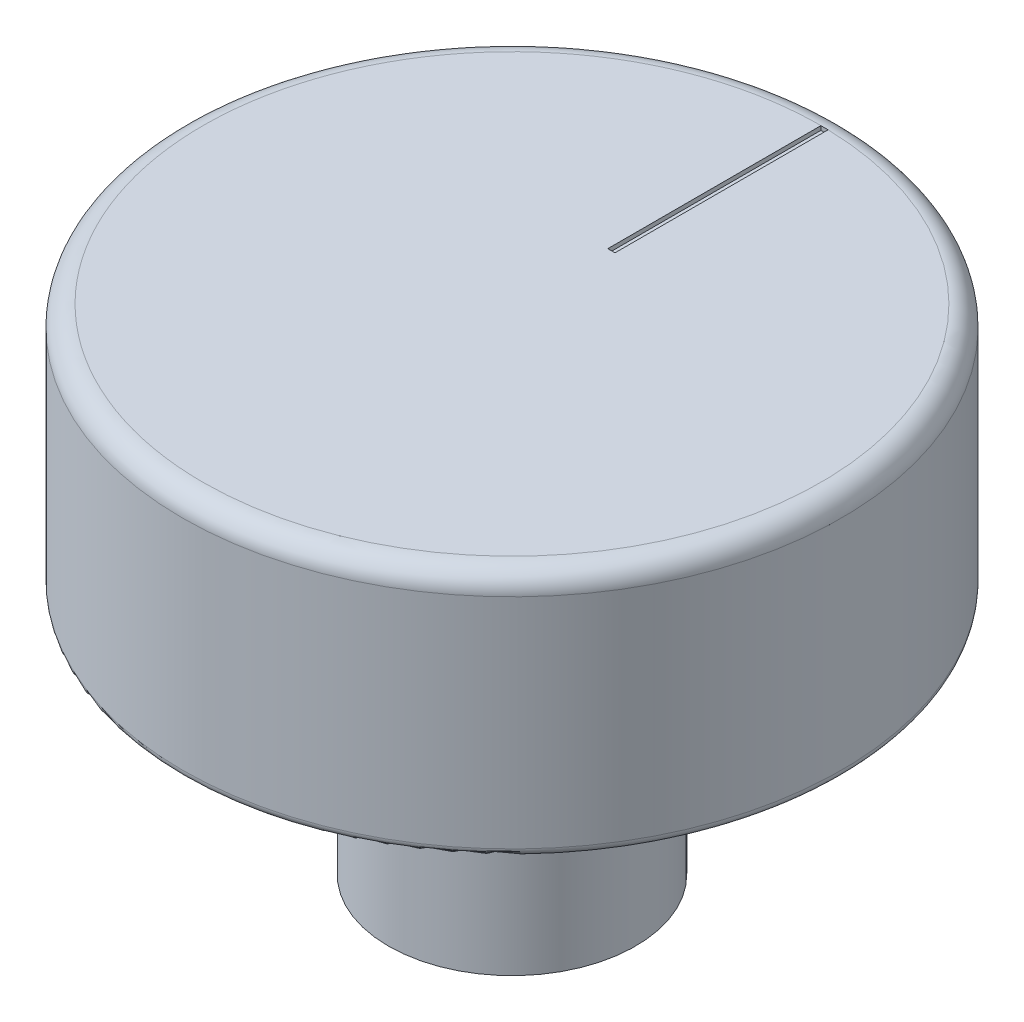
ISO-10303-21;
HEADER;
FILE_DESCRIPTION(('STEP AP214'),'2;1');
FILE_NAME('part.step','',(''),(''),'','','');
FILE_SCHEMA(('AUTOMOTIVE_DESIGN { 1 0 10303 214 1 1 1 1 }'));
ENDSEC;
DATA;
#1=APPLICATION_CONTEXT('core data for automotive mechanical design processes');
#2=APPLICATION_PROTOCOL_DEFINITION('international standard','automotive_design',2000,#1);
#3=PRODUCT_CONTEXT('',#1,'mechanical');
#4=PRODUCT('Part','Part','',(#3));
#5=PRODUCT_RELATED_PRODUCT_CATEGORY('part','',(#4));
#6=PRODUCT_DEFINITION_FORMATION('','',#4);
#7=PRODUCT_DEFINITION_CONTEXT('part definition',#1,'design');
#8=PRODUCT_DEFINITION('design','',#6,#7);
#9=PRODUCT_DEFINITION_SHAPE('','',#8);
#10=(LENGTH_UNIT() NAMED_UNIT(*) SI_UNIT(.MILLI.,.METRE.));
#11=(NAMED_UNIT(*) PLANE_ANGLE_UNIT() SI_UNIT($,.RADIAN.));
#12=(NAMED_UNIT(*) SI_UNIT($,.STERADIAN.) SOLID_ANGLE_UNIT());
#13=UNCERTAINTY_MEASURE_WITH_UNIT(LENGTH_MEASURE(1.E-05),#10,'distance_accuracy_value','');
#14=(GEOMETRIC_REPRESENTATION_CONTEXT(3) GLOBAL_UNCERTAINTY_ASSIGNED_CONTEXT((#13)) GLOBAL_UNIT_ASSIGNED_CONTEXT((#10,
#11,#12)) REPRESENTATION_CONTEXT('',''));
#15=CARTESIAN_POINT('',(0.,0.,0.));
#16=DIRECTION('',(0.,0.,1.));
#17=DIRECTION('',(1.,0.,0.));
#18=AXIS2_PLACEMENT_3D('',#15,#16,#17);
#19=CARTESIAN_POINT('',(0.,6.,0.));
#20=DIRECTION('',(0.,-1.,0.));
#21=DIRECTION('',(0.,0.,-1.));
#22=AXIS2_PLACEMENT_3D('',#19,#20,#21);
#23=CYLINDRICAL_SURFACE('',#22,3.);
#24=CARTESIAN_POINT('',(0.,6.,0.));
#25=DIRECTION('',(0.,1.,0.));
#26=DIRECTION('',(0.,0.,1.));
#27=AXIS2_PLACEMENT_3D('',#24,#25,#26);
#28=CIRCLE('',#27,3.);
#29=CARTESIAN_POINT('',(0.,6.,3.));
#30=VERTEX_POINT('',#29);
#31=EDGE_CURVE('E118',#30,#30,#28,.T.);
#32=ORIENTED_EDGE('',*,*,#31,.F.);
#33=EDGE_LOOP('',(#32));
#34=FACE_BOUND('',#33,.T.);
#35=CARTESIAN_POINT('',(0.,0.,0.));
#36=DIRECTION('',(0.,1.,0.));
#37=DIRECTION('',(0.,0.,1.));
#38=AXIS2_PLACEMENT_3D('',#35,#36,#37);
#39=CIRCLE('',#38,3.);
#40=CARTESIAN_POINT('',(0.,0.,3.));
#41=VERTEX_POINT('',#40);
#42=EDGE_CURVE('E115',#41,#41,#39,.T.);
#43=ORIENTED_EDGE('',*,*,#42,.T.);
#44=EDGE_LOOP('',(#43));
#45=FACE_BOUND('',#44,.T.);
#46=ADVANCED_FACE('F39',(#34,#45),#23,.T.);
#47=CARTESIAN_POINT('',(0.,0.,0.));
#48=DIRECTION('',(0.,1.,0.));
#49=DIRECTION('',(0.,0.,1.));
#50=AXIS2_PLACEMENT_3D('',#47,#48,#49);
#51=PLANE('',#50);
#52=ORIENTED_EDGE('',*,*,#42,.F.);
#53=EDGE_LOOP('',(#52));
#54=FACE_BOUND('',#53,.T.);
#55=ADVANCED_FACE('F150',(#54),#51,.F.);
#56=CARTESIAN_POINT('',(0.,12.,0.));
#57=DIRECTION('',(0.,-1.,0.));
#58=DIRECTION('',(0.,0.,-1.));
#59=AXIS2_PLACEMENT_3D('',#56,#57,#58);
#60=CYLINDRICAL_SURFACE('',#59,8.);
#61=CARTESIAN_POINT('',(0.,11.5,0.));
#62=DIRECTION('',(0.,1.,0.));
#63=DIRECTION('',(0.,0.,1.));
#64=AXIS2_PLACEMENT_3D('',#61,#62,#63);
#65=CIRCLE('',#64,8.);
#66=CARTESIAN_POINT('',(0.,11.5,8.));
#67=VERTEX_POINT('',#66);
#68=EDGE_CURVE('E11',#67,#67,#65,.F.);
#69=ORIENTED_EDGE('',*,*,#68,.T.);
#70=EDGE_LOOP('',(#69));
#71=FACE_BOUND('',#70,.T.);
#72=CARTESIAN_POINT('',(0.,6.2,0.));
#73=DIRECTION('',(0.,1.,0.));
#74=DIRECTION('',(0.,0.,1.));
#75=AXIS2_PLACEMENT_3D('',#72,#73,#74);
#76=CIRCLE('',#75,8.);
#77=CARTESIAN_POINT('',(0.,6.2,8.));
#78=VERTEX_POINT('',#77);
#79=EDGE_CURVE('E121',#78,#78,#76,.T.);
#80=ORIENTED_EDGE('',*,*,#79,.T.);
#81=EDGE_LOOP('',(#80));
#82=FACE_BOUND('',#81,.T.);
#83=ADVANCED_FACE('F156',(#71,#82),#60,.T.);
#84=CARTESIAN_POINT('',(0.,12.,0.));
#85=DIRECTION('',(0.,1.,0.));
#86=DIRECTION('',(0.,0.,1.));
#87=AXIS2_PLACEMENT_3D('',#84,#85,#86);
#88=PLANE('',#87);
#89=DIRECTION('',(0.,0.,1.));
#90=VECTOR('',#89,1.);
#91=CARTESIAN_POINT('',(0.,12.,-2.32546854645155));
#92=LINE('',#91,#90);
#93=CARTESIAN_POINT('',(0.,12.,-7.49795371574122));
#94=VERTEX_POINT('',#93);
#95=CARTESIAN_POINT('',(0.,12.,-2.32546854645155));
#96=VERTEX_POINT('',#95);
#97=EDGE_CURVE('E54',#94,#96,#92,.T.);
#98=ORIENTED_EDGE('',*,*,#97,.F.);
#99=DIRECTION('',(-1.,0.,0.));
#100=VECTOR('',#99,1.);
#101=CARTESIAN_POINT('',(0.,12.,-7.49795371574122));
#102=LINE('',#101,#100);
#103=CARTESIAN_POINT('',(0.175185834479934,12.,-7.49795371574122));
#104=VERTEX_POINT('',#103);
#105=EDGE_CURVE('E105',#104,#94,#102,.T.);
#106=ORIENTED_EDGE('',*,*,#105,.F.);
#107=CARTESIAN_POINT('',(0.,12.,0.));
#108=DIRECTION('',(0.,1.,0.));
#109=DIRECTION('',(0.,0.,1.));
#110=AXIS2_PLACEMENT_3D('',#107,#108,#109);
#111=CIRCLE('',#110,7.5);
#112=EDGE_CURVE('E47',#104,#104,#111,.T.);
#113=ORIENTED_EDGE('',*,*,#112,.T.);
#114=DIRECTION('',(0.,0.,-1.));
#115=VECTOR('',#114,1.);
#116=CARTESIAN_POINT('',(0.175185834479934,12.,-2.32546854645155));
#117=LINE('',#116,#115);
#118=CARTESIAN_POINT('',(0.175185834479934,12.,-2.32546854645155));
#119=VERTEX_POINT('',#118);
#120=EDGE_CURVE('E111',#119,#104,#117,.T.);
#121=ORIENTED_EDGE('',*,*,#120,.F.);
#122=DIRECTION('',(1.,0.,0.));
#123=VECTOR('',#122,1.);
#124=CARTESIAN_POINT('',(0.,12.,-2.32546854645155));
#125=LINE('',#124,#123);
#126=EDGE_CURVE('E89',#96,#119,#125,.T.);
#127=ORIENTED_EDGE('',*,*,#126,.F.);
#128=EDGE_LOOP('',(#98,#106,#113,#121,#127));
#129=FACE_BOUND('',#128,.T.);
#130=ADVANCED_FACE('F132',(#129),#88,.T.);
#131=CARTESIAN_POINT('',(0.,6.,0.));
#132=DIRECTION('',(0.,1.,0.));
#133=DIRECTION('',(0.,0.,1.));
#134=AXIS2_PLACEMENT_3D('',#131,#132,#133);
#135=PLANE('',#134);
#136=CARTESIAN_POINT('',(0.,6.,0.));
#137=DIRECTION('',(0.,1.,0.));
#138=DIRECTION('',(0.,0.,1.));
#139=AXIS2_PLACEMENT_3D('',#136,#137,#138);
#140=CIRCLE('',#139,7.8);
#141=CARTESIAN_POINT('',(0.,6.,7.8));
#142=VERTEX_POINT('',#141);
#143=EDGE_CURVE('E126',#142,#142,#140,.F.);
#144=ORIENTED_EDGE('',*,*,#143,.T.);
#145=EDGE_LOOP('',(#144));
#146=FACE_BOUND('',#145,.T.);
#147=ORIENTED_EDGE('',*,*,#31,.T.);
#148=EDGE_LOOP('',(#147));
#149=FACE_BOUND('',#148,.T.);
#150=ADVANCED_FACE('F146',(#146,#149),#135,.F.);
#151=CARTESIAN_POINT('',(0.,6.2,0.));
#152=DIRECTION('',(0.,1.,0.));
#153=DIRECTION('',(0.,0.,1.));
#154=AXIS2_PLACEMENT_3D('',#151,#152,#153);
#155=TOROIDAL_SURFACE('',#154,7.8,0.2);
#156=ORIENTED_EDGE('',*,*,#143,.F.);
#157=EDGE_LOOP('',(#156));
#158=FACE_BOUND('',#157,.T.);
#159=ORIENTED_EDGE('',*,*,#79,.F.);
#160=EDGE_LOOP('',(#159));
#161=FACE_BOUND('',#160,.T.);
#162=ADVANCED_FACE('F136',(#158,#161),#155,.T.);
#163=CARTESIAN_POINT('',(0.,11.5,0.));
#164=DIRECTION('',(0.,1.,0.));
#165=DIRECTION('',(0.,0.,1.));
#166=AXIS2_PLACEMENT_3D('',#163,#164,#165);
#167=TOROIDAL_SURFACE('',#166,7.5,0.5);
#168=ORIENTED_EDGE('',*,*,#68,.F.);
#169=EDGE_LOOP('',(#168));
#170=FACE_BOUND('',#169,.T.);
#171=ORIENTED_EDGE('',*,*,#112,.F.);
#172=EDGE_LOOP('',(#171));
#173=FACE_BOUND('',#172,.T.);
#174=ADVANCED_FACE('F41',(#170,#173),#167,.T.);
#175=CARTESIAN_POINT('',(0.,11.9,-2.32546854645155));
#176=DIRECTION('',(-1.,0.,0.));
#177=DIRECTION('',(0.,0.,1.));
#178=AXIS2_PLACEMENT_3D('',#175,#176,#177);
#179=PLANE('',#178);
#180=ORIENTED_EDGE('',*,*,#97,.T.);
#181=DIRECTION('',(0.,1.,0.));
#182=VECTOR('',#181,1.);
#183=CARTESIAN_POINT('',(0.,11.9,-2.32546854645155));
#184=LINE('',#183,#182);
#185=CARTESIAN_POINT('',(0.,11.9,-2.32546854645155));
#186=VERTEX_POINT('',#185);
#187=EDGE_CURVE('E77',#186,#96,#184,.T.);
#188=ORIENTED_EDGE('',*,*,#187,.F.);
#189=DIRECTION('',(0.,0.,1.));
#190=VECTOR('',#189,1.);
#191=CARTESIAN_POINT('',(0.,11.9,-2.32546854645155));
#192=LINE('',#191,#190);
#193=CARTESIAN_POINT('',(0.,11.9,-7.49795371574122));
#194=VERTEX_POINT('',#193);
#195=EDGE_CURVE('E103',#194,#186,#192,.T.);
#196=ORIENTED_EDGE('',*,*,#195,.F.);
#197=DIRECTION('',(0.,1.,0.));
#198=VECTOR('',#197,1.);
#199=CARTESIAN_POINT('',(0.,11.9,-7.49795371574122));
#200=LINE('',#199,#198);
#201=EDGE_CURVE('E62',#194,#94,#200,.T.);
#202=ORIENTED_EDGE('',*,*,#201,.T.);
#203=EDGE_LOOP('',(#180,#188,#196,#202));
#204=FACE_BOUND('',#203,.T.);
#205=ADVANCED_FACE('F135',(#204),#179,.F.);
#206=CARTESIAN_POINT('',(0.,11.9,-7.49795371574122));
#207=DIRECTION('',(0.,0.,-1.));
#208=DIRECTION('',(-1.,0.,0.));
#209=AXIS2_PLACEMENT_3D('',#206,#207,#208);
#210=PLANE('',#209);
#211=ORIENTED_EDGE('',*,*,#105,.T.);
#212=ORIENTED_EDGE('',*,*,#201,.F.);
#213=DIRECTION('',(-1.,0.,0.));
#214=VECTOR('',#213,1.);
#215=CARTESIAN_POINT('',(0.,11.9,-7.49795371574122));
#216=LINE('',#215,#214);
#217=CARTESIAN_POINT('',(0.175185834479934,11.9,-7.49795371574122));
#218=VERTEX_POINT('',#217);
#219=EDGE_CURVE('E100',#218,#194,#216,.T.);
#220=ORIENTED_EDGE('',*,*,#219,.F.);
#221=DIRECTION('',(0.,1.,0.));
#222=VECTOR('',#221,1.);
#223=CARTESIAN_POINT('',(0.175185834479934,11.9,-7.49795371574122));
#224=LINE('',#223,#222);
#225=EDGE_CURVE('E93',#218,#104,#224,.T.);
#226=ORIENTED_EDGE('',*,*,#225,.T.);
#227=EDGE_LOOP('',(#211,#212,#220,#226));
#228=FACE_BOUND('',#227,.T.);
#229=ADVANCED_FACE('F143',(#228),#210,.F.);
#230=CARTESIAN_POINT('',(0.175185834479934,11.9,-2.32546854645155));
#231=DIRECTION('',(1.,0.,0.));
#232=DIRECTION('',(0.,0.,-1.));
#233=AXIS2_PLACEMENT_3D('',#230,#231,#232);
#234=PLANE('',#233);
#235=ORIENTED_EDGE('',*,*,#120,.T.);
#236=ORIENTED_EDGE('',*,*,#225,.F.);
#237=DIRECTION('',(0.,0.,-1.));
#238=VECTOR('',#237,1.);
#239=CARTESIAN_POINT('',(0.175185834479934,11.9,-2.32546854645155));
#240=LINE('',#239,#238);
#241=CARTESIAN_POINT('',(0.175185834479934,11.9,-2.32546854645155));
#242=VERTEX_POINT('',#241);
#243=EDGE_CURVE('E96',#242,#218,#240,.T.);
#244=ORIENTED_EDGE('',*,*,#243,.F.);
#245=DIRECTION('',(0.,1.,0.));
#246=VECTOR('',#245,1.);
#247=CARTESIAN_POINT('',(0.175185834479934,11.9,-2.32546854645155));
#248=LINE('',#247,#246);
#249=EDGE_CURVE('E82',#242,#119,#248,.T.);
#250=ORIENTED_EDGE('',*,*,#249,.T.);
#251=EDGE_LOOP('',(#235,#236,#244,#250));
#252=FACE_BOUND('',#251,.T.);
#253=ADVANCED_FACE('F97',(#252),#234,.F.);
#254=CARTESIAN_POINT('',(0.,11.9,-2.32546854645155));
#255=DIRECTION('',(0.,0.,1.));
#256=DIRECTION('',(1.,0.,0.));
#257=AXIS2_PLACEMENT_3D('',#254,#255,#256);
#258=PLANE('',#257);
#259=ORIENTED_EDGE('',*,*,#126,.T.);
#260=ORIENTED_EDGE('',*,*,#249,.F.);
#261=DIRECTION('',(1.,0.,0.));
#262=VECTOR('',#261,1.);
#263=CARTESIAN_POINT('',(0.,11.9,-2.32546854645155));
#264=LINE('',#263,#262);
#265=EDGE_CURVE('E86',#186,#242,#264,.T.);
#266=ORIENTED_EDGE('',*,*,#265,.F.);
#267=ORIENTED_EDGE('',*,*,#187,.T.);
#268=EDGE_LOOP('',(#259,#260,#266,#267));
#269=FACE_BOUND('',#268,.T.);
#270=ADVANCED_FACE('F84',(#269),#258,.F.);
#271=CARTESIAN_POINT('',(0.,11.9,0.));
#272=DIRECTION('',(0.,-1.,0.));
#273=DIRECTION('',(0.,0.,-1.));
#274=AXIS2_PLACEMENT_3D('',#271,#272,#273);
#275=PLANE('',#274);
#276=ORIENTED_EDGE('',*,*,#195,.T.);
#277=ORIENTED_EDGE('',*,*,#265,.T.);
#278=ORIENTED_EDGE('',*,*,#243,.T.);
#279=ORIENTED_EDGE('',*,*,#219,.T.);
#280=EDGE_LOOP('',(#276,#277,#278,#279));
#281=FACE_BOUND('',#280,.T.);
#282=ADVANCED_FACE('F102',(#281),#275,.F.);
#283=CLOSED_SHELL('',(#46,#55,#83,#130,#150,#162,#174,#205,#229,#253,#270,#282));
#284=MANIFOLD_SOLID_BREP('B2',#283);
#285=ADVANCED_BREP_SHAPE_REPRESENTATION('',(#18,#284),#14);
#286=SHAPE_DEFINITION_REPRESENTATION(#9,#285);
ENDSEC;
END-ISO-10303-21;
